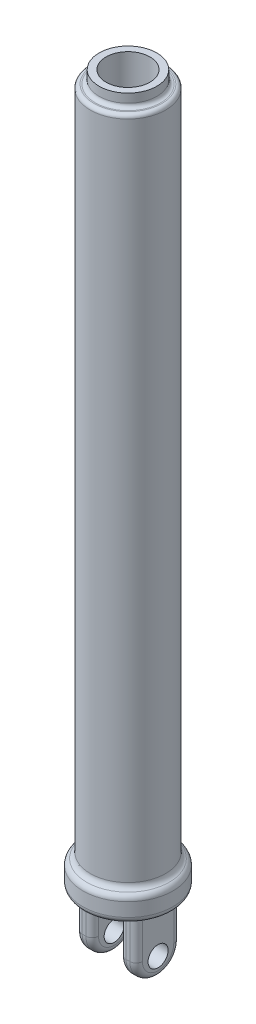
ISO-10303-21;
HEADER;
FILE_DESCRIPTION(('STEP AP214'),'2;1');
FILE_NAME('part.step','',(''),(''),'','','');
FILE_SCHEMA(('AUTOMOTIVE_DESIGN { 1 0 10303 214 1 1 1 1 }'));
ENDSEC;
DATA;
#1=APPLICATION_CONTEXT('core data for automotive mechanical design processes');
#2=APPLICATION_PROTOCOL_DEFINITION('international standard','automotive_design',2000,#1);
#3=PRODUCT_CONTEXT('',#1,'mechanical');
#4=PRODUCT('Part','Part','',(#3));
#5=PRODUCT_RELATED_PRODUCT_CATEGORY('part','',(#4));
#6=PRODUCT_DEFINITION_FORMATION('','',#4);
#7=PRODUCT_DEFINITION_CONTEXT('part definition',#1,'design');
#8=PRODUCT_DEFINITION('design','',#6,#7);
#9=PRODUCT_DEFINITION_SHAPE('','',#8);
#10=(LENGTH_UNIT() NAMED_UNIT(*) SI_UNIT(.MILLI.,.METRE.));
#11=(NAMED_UNIT(*) PLANE_ANGLE_UNIT() SI_UNIT($,.RADIAN.));
#12=(NAMED_UNIT(*) SI_UNIT($,.STERADIAN.) SOLID_ANGLE_UNIT());
#13=UNCERTAINTY_MEASURE_WITH_UNIT(LENGTH_MEASURE(1.E-05),#10,'distance_accuracy_value','');
#14=(GEOMETRIC_REPRESENTATION_CONTEXT(3) GLOBAL_UNCERTAINTY_ASSIGNED_CONTEXT((#13)) GLOBAL_UNIT_ASSIGNED_CONTEXT((#10,
#11,#12)) REPRESENTATION_CONTEXT('',''));
#15=CARTESIAN_POINT('',(0.,0.,0.));
#16=DIRECTION('',(0.,0.,1.));
#17=DIRECTION('',(1.,0.,0.));
#18=AXIS2_PLACEMENT_3D('',#15,#16,#17);
#19=CARTESIAN_POINT('',(24.,-50.,17.5));
#20=DIRECTION('',(-1.,0.,0.));
#21=DIRECTION('',(0.,0.,1.));
#22=AXIS2_PLACEMENT_3D('',#19,#20,#21);
#23=PLANE('',#22);
#24=DIRECTION('',(0.,0.,1.));
#25=VECTOR('',#24,1.);
#26=CARTESIAN_POINT('',(24.,0.,17.5));
#27=LINE('',#26,#25);
#28=CARTESIAN_POINT('',(24.,0.,-12.5));
#29=VERTEX_POINT('',#28);
#30=CARTESIAN_POINT('',(24.,0.,12.5));
#31=VERTEX_POINT('',#30);
#32=EDGE_CURVE('E307',#29,#31,#27,.T.);
#33=ORIENTED_EDGE('',*,*,#32,.T.);
#34=DIRECTION('',(0.,1.,0.));
#35=VECTOR('',#34,1.);
#36=CARTESIAN_POINT('',(24.,-50.,12.5));
#37=LINE('',#36,#35);
#38=CARTESIAN_POINT('',(24.,-32.5,12.5));
#39=VERTEX_POINT('',#38);
#40=EDGE_CURVE('E359',#31,#39,#37,.F.);
#41=ORIENTED_EDGE('',*,*,#40,.T.);
#42=CARTESIAN_POINT('',(24.,-32.5,0.));
#43=DIRECTION('',(-1.,0.,0.));
#44=DIRECTION('',(0.,0.,1.));
#45=AXIS2_PLACEMENT_3D('',#42,#43,#44);
#46=CIRCLE('',#45,12.5);
#47=CARTESIAN_POINT('',(24.,-32.5,-12.5));
#48=VERTEX_POINT('',#47);
#49=EDGE_CURVE('E355',#39,#48,#46,.F.);
#50=ORIENTED_EDGE('',*,*,#49,.T.);
#51=DIRECTION('',(0.,1.,0.));
#52=VECTOR('',#51,1.);
#53=CARTESIAN_POINT('',(24.,-50.,-12.5));
#54=LINE('',#53,#52);
#55=EDGE_CURVE('E357',#48,#29,#54,.T.);
#56=ORIENTED_EDGE('',*,*,#55,.T.);
#57=EDGE_LOOP('',(#33,#41,#50,#56));
#58=FACE_BOUND('',#57,.T.);
#59=CARTESIAN_POINT('',(24.,-35.,0.));
#60=DIRECTION('',(1.,0.,0.));
#61=DIRECTION('',(0.,0.,-1.));
#62=AXIS2_PLACEMENT_3D('',#59,#60,#61);
#63=CIRCLE('',#62,8.);
#64=CARTESIAN_POINT('',(24.,-35.,-8.00000000000002));
#65=VERTEX_POINT('',#64);
#66=EDGE_CURVE('E194',#65,#65,#63,.T.);
#67=ORIENTED_EDGE('',*,*,#66,.F.);
#68=EDGE_LOOP('',(#67));
#69=FACE_BOUND('',#68,.T.);
#70=ADVANCED_FACE('F56',(#58,#69),#23,.F.);
#71=CARTESIAN_POINT('',(11.,-50.,17.5));
#72=DIRECTION('',(1.,0.,0.));
#73=DIRECTION('',(0.,0.,-1.));
#74=AXIS2_PLACEMENT_3D('',#71,#72,#73);
#75=PLANE('',#74);
#76=CARTESIAN_POINT('',(11.,-35.,0.));
#77=DIRECTION('',(1.,0.,0.));
#78=DIRECTION('',(0.,0.,-1.));
#79=AXIS2_PLACEMENT_3D('',#76,#77,#78);
#80=CIRCLE('',#79,8.);
#81=CARTESIAN_POINT('',(11.,-35.,-8.00000000000003));
#82=VERTEX_POINT('',#81);
#83=EDGE_CURVE('E290',#82,#82,#80,.T.);
#84=ORIENTED_EDGE('',*,*,#83,.T.);
#85=EDGE_LOOP('',(#84));
#86=FACE_BOUND('',#85,.T.);
#87=CARTESIAN_POINT('',(11.,-32.5,0.));
#88=DIRECTION('',(1.,0.,0.));
#89=DIRECTION('',(0.,0.,-1.));
#90=AXIS2_PLACEMENT_3D('',#87,#88,#89);
#91=CIRCLE('',#90,12.5);
#92=CARTESIAN_POINT('',(11.,-32.5,-12.5));
#93=VERTEX_POINT('',#92);
#94=CARTESIAN_POINT('',(11.,-32.5,12.5));
#95=VERTEX_POINT('',#94);
#96=EDGE_CURVE('E365',#93,#95,#91,.F.);
#97=ORIENTED_EDGE('',*,*,#96,.T.);
#98=DIRECTION('',(0.,1.,0.));
#99=VECTOR('',#98,1.);
#100=CARTESIAN_POINT('',(11.,-50.,12.5));
#101=LINE('',#100,#99);
#102=CARTESIAN_POINT('',(11.,0.,12.5));
#103=VERTEX_POINT('',#102);
#104=EDGE_CURVE('E209',#95,#103,#101,.T.);
#105=ORIENTED_EDGE('',*,*,#104,.T.);
#106=DIRECTION('',(0.,0.,-1.));
#107=VECTOR('',#106,1.);
#108=CARTESIAN_POINT('',(11.,0.,17.5));
#109=LINE('',#108,#107);
#110=CARTESIAN_POINT('',(11.,0.,-12.5));
#111=VERTEX_POINT('',#110);
#112=EDGE_CURVE('E311',#103,#111,#109,.T.);
#113=ORIENTED_EDGE('',*,*,#112,.T.);
#114=DIRECTION('',(0.,1.,0.));
#115=VECTOR('',#114,1.);
#116=CARTESIAN_POINT('',(11.,-50.,-12.5));
#117=LINE('',#116,#115);
#118=EDGE_CURVE('E367',#111,#93,#117,.F.);
#119=ORIENTED_EDGE('',*,*,#118,.T.);
#120=EDGE_LOOP('',(#97,#105,#113,#119));
#121=FACE_BOUND('',#120,.T.);
#122=ADVANCED_FACE('F412',(#86,#121),#75,.F.);
#123=CARTESIAN_POINT('',(-11.,-50.,17.5));
#124=DIRECTION('',(-1.,0.,0.));
#125=DIRECTION('',(0.,0.,1.));
#126=AXIS2_PLACEMENT_3D('',#123,#124,#125);
#127=PLANE('',#126);
#128=CARTESIAN_POINT('',(-11.,-35.,0.));
#129=DIRECTION('',(-1.,0.,0.));
#130=DIRECTION('',(0.,0.,1.));
#131=AXIS2_PLACEMENT_3D('',#128,#129,#130);
#132=CIRCLE('',#131,8.);
#133=CARTESIAN_POINT('',(-11.,-35.,7.99999999999997));
#134=VERTEX_POINT('',#133);
#135=EDGE_CURVE('E287',#134,#134,#132,.T.);
#136=ORIENTED_EDGE('',*,*,#135,.T.);
#137=EDGE_LOOP('',(#136));
#138=FACE_BOUND('',#137,.T.);
#139=CARTESIAN_POINT('',(-11.,-32.5,0.));
#140=DIRECTION('',(-1.,0.,0.));
#141=DIRECTION('',(0.,0.,1.));
#142=AXIS2_PLACEMENT_3D('',#139,#140,#141);
#143=CIRCLE('',#142,12.5);
#144=CARTESIAN_POINT('',(-11.,-32.5,12.5));
#145=VERTEX_POINT('',#144);
#146=CARTESIAN_POINT('',(-11.,-32.5,-12.5));
#147=VERTEX_POINT('',#146);
#148=EDGE_CURVE('E370',#145,#147,#143,.F.);
#149=ORIENTED_EDGE('',*,*,#148,.T.);
#150=DIRECTION('',(0.,1.,0.));
#151=VECTOR('',#150,1.);
#152=CARTESIAN_POINT('',(-11.,-50.,-12.5));
#153=LINE('',#152,#151);
#154=CARTESIAN_POINT('',(-11.,0.,-12.5));
#155=VERTEX_POINT('',#154);
#156=EDGE_CURVE('E241',#147,#155,#153,.T.);
#157=ORIENTED_EDGE('',*,*,#156,.T.);
#158=DIRECTION('',(0.,0.,1.));
#159=VECTOR('',#158,1.);
#160=CARTESIAN_POINT('',(-11.,0.,17.5));
#161=LINE('',#160,#159);
#162=CARTESIAN_POINT('',(-11.,0.,12.5));
#163=VERTEX_POINT('',#162);
#164=EDGE_CURVE('E297',#155,#163,#161,.T.);
#165=ORIENTED_EDGE('',*,*,#164,.T.);
#166=DIRECTION('',(0.,1.,0.));
#167=VECTOR('',#166,1.);
#168=CARTESIAN_POINT('',(-11.,-50.,12.5));
#169=LINE('',#168,#167);
#170=EDGE_CURVE('E246',#163,#145,#169,.F.);
#171=ORIENTED_EDGE('',*,*,#170,.T.);
#172=EDGE_LOOP('',(#149,#157,#165,#171));
#173=FACE_BOUND('',#172,.T.);
#174=ADVANCED_FACE('F374',(#138,#173),#127,.F.);
#175=CARTESIAN_POINT('',(-24.,-50.,17.5));
#176=DIRECTION('',(1.,0.,0.));
#177=DIRECTION('',(0.,0.,-1.));
#178=AXIS2_PLACEMENT_3D('',#175,#176,#177);
#179=PLANE('',#178);
#180=CARTESIAN_POINT('',(-24.,-35.,0.));
#181=DIRECTION('',(1.,0.,0.));
#182=DIRECTION('',(0.,0.,-1.));
#183=AXIS2_PLACEMENT_3D('',#180,#181,#182);
#184=CIRCLE('',#183,8.);
#185=CARTESIAN_POINT('',(-24.,-35.,-8.00000000000004));
#186=VERTEX_POINT('',#185);
#187=EDGE_CURVE('E286',#186,#186,#184,.T.);
#188=ORIENTED_EDGE('',*,*,#187,.T.);
#189=EDGE_LOOP('',(#188));
#190=FACE_BOUND('',#189,.T.);
#191=CARTESIAN_POINT('',(-24.,-32.5,0.));
#192=DIRECTION('',(1.,0.,0.));
#193=DIRECTION('',(0.,0.,-1.));
#194=AXIS2_PLACEMENT_3D('',#191,#192,#193);
#195=CIRCLE('',#194,12.5);
#196=CARTESIAN_POINT('',(-24.,-32.5,-12.5));
#197=VERTEX_POINT('',#196);
#198=CARTESIAN_POINT('',(-24.,-32.5,12.5));
#199=VERTEX_POINT('',#198);
#200=EDGE_CURVE('E73',#197,#199,#195,.F.);
#201=ORIENTED_EDGE('',*,*,#200,.T.);
#202=DIRECTION('',(0.,1.,0.));
#203=VECTOR('',#202,1.);
#204=CARTESIAN_POINT('',(-24.,-50.,12.5));
#205=LINE('',#204,#203);
#206=CARTESIAN_POINT('',(-24.,0.,12.5));
#207=VERTEX_POINT('',#206);
#208=EDGE_CURVE('E205',#199,#207,#205,.T.);
#209=ORIENTED_EDGE('',*,*,#208,.T.);
#210=DIRECTION('',(0.,0.,-1.));
#211=VECTOR('',#210,1.);
#212=CARTESIAN_POINT('',(-24.,0.,17.5));
#213=LINE('',#212,#211);
#214=CARTESIAN_POINT('',(-24.,0.,-12.5));
#215=VERTEX_POINT('',#214);
#216=EDGE_CURVE('E303',#207,#215,#213,.T.);
#217=ORIENTED_EDGE('',*,*,#216,.T.);
#218=DIRECTION('',(0.,1.,0.));
#219=VECTOR('',#218,1.);
#220=CARTESIAN_POINT('',(-24.,-50.,-12.5));
#221=LINE('',#220,#219);
#222=EDGE_CURVE('E78',#215,#197,#221,.F.);
#223=ORIENTED_EDGE('',*,*,#222,.T.);
#224=EDGE_LOOP('',(#201,#209,#217,#223));
#225=FACE_BOUND('',#224,.T.);
#226=ADVANCED_FACE('F397',(#190,#225),#179,.F.);
#227=CARTESIAN_POINT('',(11.,-50.,-17.5));
#228=DIRECTION('',(0.,0.,1.));
#229=DIRECTION('',(1.,0.,0.));
#230=AXIS2_PLACEMENT_3D('',#227,#228,#229);
#231=PLANE('',#230);
#232=DIRECTION('',(1.,0.,0.));
#233=VECTOR('',#232,1.);
#234=CARTESIAN_POINT('',(11.,0.,-17.5));
#235=LINE('',#234,#233);
#236=CARTESIAN_POINT('',(16.,0.,-17.5));
#237=VERTEX_POINT('',#236);
#238=CARTESIAN_POINT('',(19.,0.,-17.5));
#239=VERTEX_POINT('',#238);
#240=EDGE_CURVE('E314',#237,#239,#235,.T.);
#241=ORIENTED_EDGE('',*,*,#240,.T.);
#242=DIRECTION('',(0.,1.,0.));
#243=VECTOR('',#242,1.);
#244=CARTESIAN_POINT('',(19.,-50.,-17.5));
#245=LINE('',#244,#243);
#246=CARTESIAN_POINT('',(19.,-32.5,-17.5));
#247=VERTEX_POINT('',#246);
#248=EDGE_CURVE('E363',#239,#247,#245,.F.);
#249=ORIENTED_EDGE('',*,*,#248,.T.);
#250=DIRECTION('',(1.,0.,0.));
#251=VECTOR('',#250,1.);
#252=CARTESIAN_POINT('',(-35.8238545691089,-32.5,-17.5));
#253=LINE('',#252,#251);
#254=CARTESIAN_POINT('',(16.,-32.5,-17.5));
#255=VERTEX_POINT('',#254);
#256=EDGE_CURVE('E293',#255,#247,#253,.T.);
#257=ORIENTED_EDGE('',*,*,#256,.F.);
#258=DIRECTION('',(0.,1.,0.));
#259=VECTOR('',#258,1.);
#260=CARTESIAN_POINT('',(16.,-50.,-17.5));
#261=LINE('',#260,#259);
#262=EDGE_CURVE('E361',#255,#237,#261,.T.);
#263=ORIENTED_EDGE('',*,*,#262,.T.);
#264=EDGE_LOOP('',(#241,#249,#257,#263));
#265=FACE_BOUND('',#264,.T.);
#266=ADVANCED_FACE('F593',(#265),#231,.F.);
#267=CARTESIAN_POINT('',(-11.,-50.,-17.5));
#268=DIRECTION('',(0.,0.,1.));
#269=DIRECTION('',(1.,0.,0.));
#270=AXIS2_PLACEMENT_3D('',#267,#268,#269);
#271=PLANE('',#270);
#272=DIRECTION('',(1.,0.,0.));
#273=VECTOR('',#272,1.);
#274=CARTESIAN_POINT('',(-11.,0.,-17.5));
#275=LINE('',#274,#273);
#276=CARTESIAN_POINT('',(-19.,0.,-17.5));
#277=VERTEX_POINT('',#276);
#278=CARTESIAN_POINT('',(-16.,0.,-17.5));
#279=VERTEX_POINT('',#278);
#280=EDGE_CURVE('E305',#277,#279,#275,.T.);
#281=ORIENTED_EDGE('',*,*,#280,.T.);
#282=DIRECTION('',(0.,1.,0.));
#283=VECTOR('',#282,1.);
#284=CARTESIAN_POINT('',(-16.,-50.,-17.5));
#285=LINE('',#284,#283);
#286=CARTESIAN_POINT('',(-16.,-32.5,-17.5));
#287=VERTEX_POINT('',#286);
#288=EDGE_CURVE('E240',#279,#287,#285,.F.);
#289=ORIENTED_EDGE('',*,*,#288,.T.);
#290=CARTESIAN_POINT('',(-19.,-32.5,-17.5));
#291=VERTEX_POINT('',#290);
#292=EDGE_CURVE('E294',#291,#287,#253,.T.);
#293=ORIENTED_EDGE('',*,*,#292,.F.);
#294=DIRECTION('',(0.,1.,0.));
#295=VECTOR('',#294,1.);
#296=CARTESIAN_POINT('',(-19.,-50.,-17.5));
#297=LINE('',#296,#295);
#298=EDGE_CURVE('E235',#291,#277,#297,.T.);
#299=ORIENTED_EDGE('',*,*,#298,.T.);
#300=EDGE_LOOP('',(#281,#289,#293,#299));
#301=FACE_BOUND('',#300,.T.);
#302=ADVANCED_FACE('F398',(#301),#271,.F.);
#303=CARTESIAN_POINT('',(0.,0.,0.));
#304=DIRECTION('',(0.,-1.,0.));
#305=DIRECTION('',(0.,0.,-1.));
#306=AXIS2_PLACEMENT_3D('',#303,#304,#305);
#307=PLANE('',#306);
#308=CARTESIAN_POINT('',(0.,0.,0.));
#309=DIRECTION('',(0.,1.,0.));
#310=DIRECTION('',(0.,0.,1.));
#311=AXIS2_PLACEMENT_3D('',#308,#309,#310);
#312=CIRCLE('',#311,30.8238545691088);
#313=CARTESIAN_POINT('',(0.,0.,30.8238545691088));
#314=VERTEX_POINT('',#313);
#315=EDGE_CURVE('E183',#314,#314,#312,.T.);
#316=ORIENTED_EDGE('',*,*,#315,.F.);
#317=EDGE_LOOP('',(#316));
#318=FACE_BOUND('',#317,.T.);
#319=DIRECTION('',(-1.,0.,0.));
#320=VECTOR('',#319,1.);
#321=CARTESIAN_POINT('',(11.,0.,17.5));
#322=LINE('',#321,#320);
#323=CARTESIAN_POINT('',(19.,0.,17.5));
#324=VERTEX_POINT('',#323);
#325=CARTESIAN_POINT('',(16.,0.,17.5));
#326=VERTEX_POINT('',#325);
#327=EDGE_CURVE('E179',#324,#326,#322,.T.);
#328=ORIENTED_EDGE('',*,*,#327,.F.);
#329=CARTESIAN_POINT('',(19.,0.,12.5));
#330=DIRECTION('',(0.,-1.,0.));
#331=DIRECTION('',(0.,0.,-1.));
#332=AXIS2_PLACEMENT_3D('',#329,#330,#331);
#333=CIRCLE('',#332,5.);
#334=EDGE_CURVE('E260',#324,#31,#333,.F.);
#335=ORIENTED_EDGE('',*,*,#334,.T.);
#336=ORIENTED_EDGE('',*,*,#32,.F.);
#337=CARTESIAN_POINT('',(19.,0.,-12.5));
#338=DIRECTION('',(0.,-1.,0.));
#339=DIRECTION('',(0.,0.,-1.));
#340=AXIS2_PLACEMENT_3D('',#337,#338,#339);
#341=CIRCLE('',#340,5.);
#342=EDGE_CURVE('E262',#29,#239,#341,.F.);
#343=ORIENTED_EDGE('',*,*,#342,.T.);
#344=ORIENTED_EDGE('',*,*,#240,.F.);
#345=CARTESIAN_POINT('',(16.,0.,-12.5));
#346=DIRECTION('',(0.,-1.,0.));
#347=DIRECTION('',(0.,0.,-1.));
#348=AXIS2_PLACEMENT_3D('',#345,#346,#347);
#349=CIRCLE('',#348,5.);
#350=EDGE_CURVE('E266',#237,#111,#349,.F.);
#351=ORIENTED_EDGE('',*,*,#350,.T.);
#352=ORIENTED_EDGE('',*,*,#112,.F.);
#353=CARTESIAN_POINT('',(16.,0.,12.5));
#354=DIRECTION('',(0.,-1.,0.));
#355=DIRECTION('',(0.,0.,-1.));
#356=AXIS2_PLACEMENT_3D('',#353,#354,#355);
#357=CIRCLE('',#356,5.);
#358=EDGE_CURVE('E264',#103,#326,#357,.F.);
#359=ORIENTED_EDGE('',*,*,#358,.T.);
#360=EDGE_LOOP('',(#328,#335,#336,#343,#344,#351,#352,#359));
#361=FACE_BOUND('',#360,.T.);
#362=DIRECTION('',(-1.,0.,0.));
#363=VECTOR('',#362,1.);
#364=CARTESIAN_POINT('',(-11.,0.,17.5));
#365=LINE('',#364,#363);
#366=CARTESIAN_POINT('',(-16.,0.,17.5));
#367=VERTEX_POINT('',#366);
#368=CARTESIAN_POINT('',(-19.,0.,17.5));
#369=VERTEX_POINT('',#368);
#370=EDGE_CURVE('E300',#367,#369,#365,.T.);
#371=ORIENTED_EDGE('',*,*,#370,.F.);
#372=CARTESIAN_POINT('',(-16.,0.,12.5));
#373=DIRECTION('',(0.,-1.,0.));
#374=DIRECTION('',(0.,0.,-1.));
#375=AXIS2_PLACEMENT_3D('',#372,#373,#374);
#376=CIRCLE('',#375,5.);
#377=EDGE_CURVE('E270',#367,#163,#376,.F.);
#378=ORIENTED_EDGE('',*,*,#377,.T.);
#379=ORIENTED_EDGE('',*,*,#164,.F.);
#380=CARTESIAN_POINT('',(-16.,0.,-12.5));
#381=DIRECTION('',(0.,-1.,0.));
#382=DIRECTION('',(0.,0.,-1.));
#383=AXIS2_PLACEMENT_3D('',#380,#381,#382);
#384=CIRCLE('',#383,5.);
#385=EDGE_CURVE('E268',#155,#279,#384,.F.);
#386=ORIENTED_EDGE('',*,*,#385,.T.);
#387=ORIENTED_EDGE('',*,*,#280,.F.);
#388=CARTESIAN_POINT('',(-19.,0.,-12.5));
#389=DIRECTION('',(0.,-1.,0.));
#390=DIRECTION('',(0.,0.,-1.));
#391=AXIS2_PLACEMENT_3D('',#388,#389,#390);
#392=CIRCLE('',#391,5.);
#393=EDGE_CURVE('E12',#277,#215,#392,.F.);
#394=ORIENTED_EDGE('',*,*,#393,.T.);
#395=ORIENTED_EDGE('',*,*,#216,.F.);
#396=CARTESIAN_POINT('',(-19.,0.,12.5));
#397=DIRECTION('',(0.,-1.,0.));
#398=DIRECTION('',(0.,0.,-1.));
#399=AXIS2_PLACEMENT_3D('',#396,#397,#398);
#400=CIRCLE('',#399,5.);
#401=EDGE_CURVE('E65',#207,#369,#400,.F.);
#402=ORIENTED_EDGE('',*,*,#401,.T.);
#403=EDGE_LOOP('',(#371,#378,#379,#386,#387,#394,#395,#402));
#404=FACE_BOUND('',#403,.T.);
#405=ADVANCED_FACE('F391',(#318,#361,#404),#307,.T.);
#406=CARTESIAN_POINT('',(0.,5.,0.));
#407=DIRECTION('',(0.,1.,0.));
#408=DIRECTION('',(0.,0.,1.));
#409=AXIS2_PLACEMENT_3D('',#406,#407,#408);
#410=TOROIDAL_SURFACE('',#409,30.8238545691088,5.);
#411=ORIENTED_EDGE('',*,*,#315,.T.);
#412=EDGE_LOOP('',(#411));
#413=FACE_BOUND('',#412,.T.);
#414=CARTESIAN_POINT('',(0.,5.,0.));
#415=DIRECTION('',(0.,1.,0.));
#416=DIRECTION('',(0.,0.,1.));
#417=AXIS2_PLACEMENT_3D('',#414,#415,#416);
#418=CIRCLE('',#417,35.8238545691088);
#419=CARTESIAN_POINT('',(0.,5.,35.8238545691088));
#420=VERTEX_POINT('',#419);
#421=EDGE_CURVE('E347',#420,#420,#418,.T.);
#422=ORIENTED_EDGE('',*,*,#421,.F.);
#423=EDGE_LOOP('',(#422));
#424=FACE_BOUND('',#423,.T.);
#425=ADVANCED_FACE('F466',(#413,#424),#410,.T.);
#426=CARTESIAN_POINT('',(0.,40.,0.));
#427=DIRECTION('',(0.,1.,0.));
#428=DIRECTION('',(0.,0.,1.));
#429=AXIS2_PLACEMENT_3D('',#426,#427,#428);
#430=CYLINDRICAL_SURFACE('',#429,35.8238545691088);
#431=ORIENTED_EDGE('',*,*,#421,.T.);
#432=EDGE_LOOP('',(#431));
#433=FACE_BOUND('',#432,.T.);
#434=CARTESIAN_POINT('',(0.,15.8911155052431,0.));
#435=DIRECTION('',(0.,1.,0.));
#436=DIRECTION('',(0.,0.,1.));
#437=AXIS2_PLACEMENT_3D('',#434,#435,#436);
#438=CIRCLE('',#437,35.8238545691088);
#439=CARTESIAN_POINT('',(0.,15.8911155052431,35.8238545691088));
#440=VERTEX_POINT('',#439);
#441=EDGE_CURVE('E344',#440,#440,#438,.T.);
#442=ORIENTED_EDGE('',*,*,#441,.F.);
#443=EDGE_LOOP('',(#442));
#444=FACE_BOUND('',#443,.T.);
#445=ADVANCED_FACE('F462',(#433,#444),#430,.T.);
#446=CARTESIAN_POINT('',(0.,15.8911155052431,0.));
#447=DIRECTION('',(0.,1.,0.));
#448=DIRECTION('',(0.,0.,1.));
#449=AXIS2_PLACEMENT_3D('',#446,#447,#448);
#450=TOROIDAL_SURFACE('',#449,30.8238545691088,5.);
#451=ORIENTED_EDGE('',*,*,#441,.T.);
#452=EDGE_LOOP('',(#451));
#453=FACE_BOUND('',#452,.T.);
#454=CARTESIAN_POINT('',(0.,20.434236936045,0.));
#455=DIRECTION('',(0.,1.,0.));
#456=DIRECTION('',(0.,0.,1.));
#457=AXIS2_PLACEMENT_3D('',#454,#455,#456);
#458=CIRCLE('',#457,32.9119272845545);
#459=CARTESIAN_POINT('',(0.,20.434236936045,32.9119272845545));
#460=VERTEX_POINT('',#459);
#461=EDGE_CURVE('E341',#460,#460,#458,.T.);
#462=ORIENTED_EDGE('',*,*,#461,.F.);
#463=EDGE_LOOP('',(#462));
#464=FACE_BOUND('',#463,.T.);
#465=ADVANCED_FACE('F458',(#453,#464),#450,.T.);
#466=CARTESIAN_POINT('',(0.,24.9773583668469,0.));
#467=DIRECTION('',(0.,1.,0.));
#468=DIRECTION('',(0.,0.,1.));
#469=AXIS2_PLACEMENT_3D('',#466,#467,#468);
#470=TOROIDAL_SURFACE('',#469,35.0000000000001,4.99999999999999);
#471=ORIENTED_EDGE('',*,*,#461,.T.);
#472=EDGE_LOOP('',(#471));
#473=FACE_BOUND('',#472,.T.);
#474=CARTESIAN_POINT('',(0.,24.9773583668469,0.));
#475=DIRECTION('',(0.,1.,0.));
#476=DIRECTION('',(0.,0.,1.));
#477=AXIS2_PLACEMENT_3D('',#474,#475,#476);
#478=CIRCLE('',#477,30.0000000000001);
#479=CARTESIAN_POINT('',(0.,24.9773583668469,30.0000000000001));
#480=VERTEX_POINT('',#479);
#481=EDGE_CURVE('E338',#480,#480,#478,.T.);
#482=ORIENTED_EDGE('',*,*,#481,.F.);
#483=EDGE_LOOP('',(#482));
#484=FACE_BOUND('',#483,.T.);
#485=ADVANCED_FACE('F454',(#473,#484),#470,.F.);
#486=CARTESIAN_POINT('',(0.,40.,0.));
#487=DIRECTION('',(0.,1.,0.));
#488=DIRECTION('',(0.,0.,1.));
#489=AXIS2_PLACEMENT_3D('',#486,#487,#488);
#490=CYLINDRICAL_SURFACE('',#489,30.);
#491=ORIENTED_EDGE('',*,*,#481,.T.);
#492=EDGE_LOOP('',(#491));
#493=FACE_BOUND('',#492,.T.);
#494=CARTESIAN_POINT('',(0.,552.,0.));
#495=DIRECTION('',(0.,1.,0.));
#496=DIRECTION('',(0.,0.,1.));
#497=AXIS2_PLACEMENT_3D('',#494,#495,#496);
#498=CIRCLE('',#497,30.);
#499=CARTESIAN_POINT('',(0.,552.,30.));
#500=VERTEX_POINT('',#499);
#501=EDGE_CURVE('E335',#500,#500,#498,.T.);
#502=ORIENTED_EDGE('',*,*,#501,.F.);
#503=EDGE_LOOP('',(#502));
#504=FACE_BOUND('',#503,.T.);
#505=ADVANCED_FACE('F450',(#493,#504),#490,.T.);
#506=CARTESIAN_POINT('',(0.,552.,0.));
#507=DIRECTION('',(0.,1.,0.));
#508=DIRECTION('',(0.,0.,1.));
#509=AXIS2_PLACEMENT_3D('',#506,#507,#508);
#510=TOROIDAL_SURFACE('',#509,27.,3.);
#511=ORIENTED_EDGE('',*,*,#501,.T.);
#512=EDGE_LOOP('',(#511));
#513=FACE_BOUND('',#512,.T.);
#514=CARTESIAN_POINT('',(0.,555.,0.));
#515=DIRECTION('',(0.,1.,0.));
#516=DIRECTION('',(0.,0.,1.));
#517=AXIS2_PLACEMENT_3D('',#514,#515,#516);
#518=CIRCLE('',#517,27.);
#519=CARTESIAN_POINT('',(0.,555.,27.));
#520=VERTEX_POINT('',#519);
#521=EDGE_CURVE('E332',#520,#520,#518,.T.);
#522=ORIENTED_EDGE('',*,*,#521,.F.);
#523=EDGE_LOOP('',(#522));
#524=FACE_BOUND('',#523,.T.);
#525=ADVANCED_FACE('F446',(#513,#524),#510,.T.);
#526=CARTESIAN_POINT('',(-27.,555.,0.));
#527=DIRECTION('',(0.,1.,0.));
#528=DIRECTION('',(0.,0.,1.));
#529=AXIS2_PLACEMENT_3D('',#526,#527,#528);
#530=PLANE('',#529);
#531=ORIENTED_EDGE('',*,*,#521,.T.);
#532=EDGE_LOOP('',(#531));
#533=FACE_BOUND('',#532,.T.);
#534=CARTESIAN_POINT('',(0.,555.,0.));
#535=DIRECTION('',(0.,1.,0.));
#536=DIRECTION('',(0.,0.,1.));
#537=AXIS2_PLACEMENT_3D('',#534,#535,#536);
#538=CIRCLE('',#537,26.);
#539=CARTESIAN_POINT('',(0.,555.,26.));
#540=VERTEX_POINT('',#539);
#541=EDGE_CURVE('E329',#540,#540,#538,.T.);
#542=ORIENTED_EDGE('',*,*,#541,.F.);
#543=EDGE_LOOP('',(#542));
#544=FACE_BOUND('',#543,.T.);
#545=ADVANCED_FACE('F442',(#533,#544),#530,.T.);
#546=CARTESIAN_POINT('',(0.,558.,0.));
#547=DIRECTION('',(0.,1.,0.));
#548=DIRECTION('',(0.,0.,1.));
#549=AXIS2_PLACEMENT_3D('',#546,#547,#548);
#550=TOROIDAL_SURFACE('',#549,26.,3.00000000000011);
#551=ORIENTED_EDGE('',*,*,#541,.T.);
#552=EDGE_LOOP('',(#551));
#553=FACE_BOUND('',#552,.T.);
#554=CARTESIAN_POINT('',(0.,558.,0.));
#555=DIRECTION('',(0.,1.,0.));
#556=DIRECTION('',(0.,0.,1.));
#557=AXIS2_PLACEMENT_3D('',#554,#555,#556);
#558=CIRCLE('',#557,22.9999999999999);
#559=CARTESIAN_POINT('',(0.,558.,22.9999999999999));
#560=VERTEX_POINT('',#559);
#561=EDGE_CURVE('E326',#560,#560,#558,.T.);
#562=ORIENTED_EDGE('',*,*,#561,.F.);
#563=EDGE_LOOP('',(#562));
#564=FACE_BOUND('',#563,.T.);
#565=ADVANCED_FACE('F438',(#553,#564),#550,.F.);
#566=CARTESIAN_POINT('',(0.,40.,0.));
#567=DIRECTION('',(0.,1.,0.));
#568=DIRECTION('',(0.,0.,1.));
#569=AXIS2_PLACEMENT_3D('',#566,#567,#568);
#570=CYLINDRICAL_SURFACE('',#569,22.9999999999999);
#571=ORIENTED_EDGE('',*,*,#561,.T.);
#572=EDGE_LOOP('',(#571));
#573=FACE_BOUND('',#572,.T.);
#574=CARTESIAN_POINT('',(0.,565.,0.));
#575=DIRECTION('',(0.,1.,0.));
#576=DIRECTION('',(0.,0.,1.));
#577=AXIS2_PLACEMENT_3D('',#574,#575,#576);
#578=CIRCLE('',#577,23.);
#579=CARTESIAN_POINT('',(0.,565.,23.));
#580=VERTEX_POINT('',#579);
#581=EDGE_CURVE('E323',#580,#580,#578,.T.);
#582=ORIENTED_EDGE('',*,*,#581,.F.);
#583=EDGE_LOOP('',(#582));
#584=FACE_BOUND('',#583,.T.);
#585=ADVANCED_FACE('F434',(#573,#584),#570,.T.);
#586=CARTESIAN_POINT('',(-17.5,565.,0.));
#587=DIRECTION('',(0.,1.,0.));
#588=DIRECTION('',(0.,0.,1.));
#589=AXIS2_PLACEMENT_3D('',#586,#587,#588);
#590=PLANE('',#589);
#591=ORIENTED_EDGE('',*,*,#581,.T.);
#592=EDGE_LOOP('',(#591));
#593=FACE_BOUND('',#592,.T.);
#594=CARTESIAN_POINT('',(0.,565.,0.));
#595=DIRECTION('',(0.,1.,0.));
#596=DIRECTION('',(0.,0.,1.));
#597=AXIS2_PLACEMENT_3D('',#594,#595,#596);
#598=CIRCLE('',#597,17.5);
#599=CARTESIAN_POINT('',(0.,565.,17.5));
#600=VERTEX_POINT('',#599);
#601=EDGE_CURVE('E320',#600,#600,#598,.T.);
#602=ORIENTED_EDGE('',*,*,#601,.F.);
#603=EDGE_LOOP('',(#602));
#604=FACE_BOUND('',#603,.T.);
#605=ADVANCED_FACE('F430',(#593,#604),#590,.T.);
#606=CARTESIAN_POINT('',(0.,40.,0.));
#607=DIRECTION('',(0.,1.,0.));
#608=DIRECTION('',(0.,0.,1.));
#609=AXIS2_PLACEMENT_3D('',#606,#607,#608);
#610=CYLINDRICAL_SURFACE('',#609,17.5);
#611=ORIENTED_EDGE('',*,*,#601,.T.);
#612=EDGE_LOOP('',(#611));
#613=FACE_BOUND('',#612,.T.);
#614=CARTESIAN_POINT('',(0.,40.,0.));
#615=DIRECTION('',(0.,1.,0.));
#616=DIRECTION('',(0.,0.,1.));
#617=AXIS2_PLACEMENT_3D('',#614,#615,#616);
#618=CIRCLE('',#617,17.4999999999999);
#619=CARTESIAN_POINT('',(0.,40.,17.4999999999999));
#620=VERTEX_POINT('',#619);
#621=EDGE_CURVE('E317',#620,#620,#618,.T.);
#622=ORIENTED_EDGE('',*,*,#621,.F.);
#623=EDGE_LOOP('',(#622));
#624=FACE_BOUND('',#623,.T.);
#625=ADVANCED_FACE('F426',(#613,#624),#610,.F.);
#626=CARTESIAN_POINT('',(-17.4999999999999,40.,0.));
#627=DIRECTION('',(0.,1.,0.));
#628=DIRECTION('',(0.,0.,1.));
#629=AXIS2_PLACEMENT_3D('',#626,#627,#628);
#630=PLANE('',#629);
#631=ORIENTED_EDGE('',*,*,#621,.T.);
#632=EDGE_LOOP('',(#631));
#633=FACE_BOUND('',#632,.T.);
#634=ADVANCED_FACE('F423',(#633),#630,.T.);
#635=CARTESIAN_POINT('',(11.,-50.,17.5));
#636=DIRECTION('',(0.,0.,-1.));
#637=DIRECTION('',(-1.,0.,0.));
#638=AXIS2_PLACEMENT_3D('',#635,#636,#637);
#639=PLANE('',#638);
#640=DIRECTION('',(1.,0.,0.));
#641=VECTOR('',#640,1.);
#642=CARTESIAN_POINT('',(-35.8238545691089,-32.5,17.5));
#643=LINE('',#642,#641);
#644=CARTESIAN_POINT('',(16.,-32.5,17.5));
#645=VERTEX_POINT('',#644);
#646=CARTESIAN_POINT('',(19.,-32.5,17.5));
#647=VERTEX_POINT('',#646);
#648=EDGE_CURVE('E176',#645,#647,#643,.T.);
#649=ORIENTED_EDGE('',*,*,#648,.T.);
#650=DIRECTION('',(0.,1.,0.));
#651=VECTOR('',#650,1.);
#652=CARTESIAN_POINT('',(19.,-50.,17.5));
#653=LINE('',#652,#651);
#654=EDGE_CURVE('E182',#647,#324,#653,.T.);
#655=ORIENTED_EDGE('',*,*,#654,.T.);
#656=ORIENTED_EDGE('',*,*,#327,.T.);
#657=DIRECTION('',(0.,1.,0.));
#658=VECTOR('',#657,1.);
#659=CARTESIAN_POINT('',(16.,-50.,17.5));
#660=LINE('',#659,#658);
#661=EDGE_CURVE('E172',#326,#645,#660,.F.);
#662=ORIENTED_EDGE('',*,*,#661,.T.);
#663=EDGE_LOOP('',(#649,#655,#656,#662));
#664=FACE_BOUND('',#663,.T.);
#665=ADVANCED_FACE('F174',(#664),#639,.F.);
#666=CARTESIAN_POINT('',(-11.,-50.,17.5));
#667=DIRECTION('',(0.,0.,-1.));
#668=DIRECTION('',(-1.,0.,0.));
#669=AXIS2_PLACEMENT_3D('',#666,#667,#668);
#670=PLANE('',#669);
#671=CARTESIAN_POINT('',(-19.,-32.5,17.5));
#672=VERTEX_POINT('',#671);
#673=CARTESIAN_POINT('',(-16.,-32.5,17.5));
#674=VERTEX_POINT('',#673);
#675=EDGE_CURVE('E193',#672,#674,#643,.T.);
#676=ORIENTED_EDGE('',*,*,#675,.T.);
#677=DIRECTION('',(0.,1.,0.));
#678=VECTOR('',#677,1.);
#679=CARTESIAN_POINT('',(-16.,-50.,17.5));
#680=LINE('',#679,#678);
#681=EDGE_CURVE('E251',#674,#367,#680,.T.);
#682=ORIENTED_EDGE('',*,*,#681,.T.);
#683=ORIENTED_EDGE('',*,*,#370,.T.);
#684=DIRECTION('',(0.,1.,0.));
#685=VECTOR('',#684,1.);
#686=CARTESIAN_POINT('',(-19.,-50.,17.5));
#687=LINE('',#686,#685);
#688=EDGE_CURVE('E243',#369,#672,#687,.F.);
#689=ORIENTED_EDGE('',*,*,#688,.T.);
#690=EDGE_LOOP('',(#676,#682,#683,#689));
#691=FACE_BOUND('',#690,.T.);
#692=ADVANCED_FACE('F394',(#691),#670,.F.);
#693=CARTESIAN_POINT('',(-35.8238545691089,-32.5,0.));
#694=DIRECTION('',(1.,0.,0.));
#695=DIRECTION('',(0.,0.,-1.));
#696=AXIS2_PLACEMENT_3D('',#693,#694,#695);
#697=CYLINDRICAL_SURFACE('',#696,17.5);
#698=ORIENTED_EDGE('',*,*,#292,.T.);
#699=CARTESIAN_POINT('',(-16.,-32.5,0.));
#700=DIRECTION('',(-1.,0.,0.));
#701=DIRECTION('',(0.,0.,1.));
#702=AXIS2_PLACEMENT_3D('',#699,#700,#701);
#703=CIRCLE('',#702,17.5);
#704=EDGE_CURVE('E258',#287,#674,#703,.T.);
#705=ORIENTED_EDGE('',*,*,#704,.T.);
#706=ORIENTED_EDGE('',*,*,#675,.F.);
#707=CARTESIAN_POINT('',(-19.,-32.5,0.));
#708=DIRECTION('',(1.,0.,0.));
#709=DIRECTION('',(0.,0.,-1.));
#710=AXIS2_PLACEMENT_3D('',#707,#708,#709);
#711=CIRCLE('',#710,17.5);
#712=EDGE_CURVE('E231',#672,#291,#711,.T.);
#713=ORIENTED_EDGE('',*,*,#712,.T.);
#714=EDGE_LOOP('',(#698,#705,#706,#713));
#715=FACE_BOUND('',#714,.T.);
#716=ADVANCED_FACE('F400',(#715),#697,.T.);
#717=ORIENTED_EDGE('',*,*,#256,.T.);
#718=CARTESIAN_POINT('',(19.,-32.5,0.));
#719=DIRECTION('',(-1.,0.,0.));
#720=DIRECTION('',(0.,0.,1.));
#721=AXIS2_PLACEMENT_3D('',#718,#719,#720);
#722=CIRCLE('',#721,17.5);
#723=EDGE_CURVE('E192',#247,#647,#722,.T.);
#724=ORIENTED_EDGE('',*,*,#723,.T.);
#725=ORIENTED_EDGE('',*,*,#648,.F.);
#726=CARTESIAN_POINT('',(16.,-32.5,0.));
#727=DIRECTION('',(1.,0.,0.));
#728=DIRECTION('',(0.,0.,-1.));
#729=AXIS2_PLACEMENT_3D('',#726,#727,#728);
#730=CIRCLE('',#729,17.5);
#731=EDGE_CURVE('E189',#645,#255,#730,.T.);
#732=ORIENTED_EDGE('',*,*,#731,.T.);
#733=EDGE_LOOP('',(#717,#724,#725,#732));
#734=FACE_BOUND('',#733,.T.);
#735=ADVANCED_FACE('F188',(#734),#697,.T.);
#736=CARTESIAN_POINT('',(-35.8238545691089,-35.,0.));
#737=DIRECTION('',(1.,0.,0.));
#738=DIRECTION('',(0.,0.,-1.));
#739=AXIS2_PLACEMENT_3D('',#736,#737,#738);
#740=CYLINDRICAL_SURFACE('',#739,8.);
#741=ORIENTED_EDGE('',*,*,#187,.F.);
#742=EDGE_LOOP('',(#741));
#743=FACE_BOUND('',#742,.T.);
#744=ORIENTED_EDGE('',*,*,#135,.F.);
#745=EDGE_LOOP('',(#744));
#746=FACE_BOUND('',#745,.T.);
#747=ADVANCED_FACE('F407',(#743,#746),#740,.F.);
#748=ORIENTED_EDGE('',*,*,#66,.T.);
#749=EDGE_LOOP('',(#748));
#750=FACE_BOUND('',#749,.T.);
#751=ORIENTED_EDGE('',*,*,#83,.F.);
#752=EDGE_LOOP('',(#751));
#753=FACE_BOUND('',#752,.T.);
#754=ADVANCED_FACE('F484',(#750,#753),#740,.F.);
#755=CARTESIAN_POINT('',(19.,-50.,-12.5));
#756=DIRECTION('',(0.,1.,0.));
#757=DIRECTION('',(0.,0.,1.));
#758=AXIS2_PLACEMENT_3D('',#755,#756,#757);
#759=CYLINDRICAL_SURFACE('',#758,5.);
#760=ORIENTED_EDGE('',*,*,#342,.F.);
#761=ORIENTED_EDGE('',*,*,#55,.F.);
#762=CARTESIAN_POINT('',(19.,-32.5,-12.5));
#763=DIRECTION('',(0.,-1.,0.));
#764=DIRECTION('',(0.,0.,-1.));
#765=AXIS2_PLACEMENT_3D('',#762,#763,#764);
#766=CIRCLE('',#765,5.);
#767=EDGE_CURVE('E218',#247,#48,#766,.T.);
#768=ORIENTED_EDGE('',*,*,#767,.F.);
#769=ORIENTED_EDGE('',*,*,#248,.F.);
#770=EDGE_LOOP('',(#760,#761,#768,#769));
#771=FACE_BOUND('',#770,.T.);
#772=ADVANCED_FACE('F481',(#771),#759,.T.);
#773=CARTESIAN_POINT('',(19.,-32.5,0.));
#774=DIRECTION('',(-1.,0.,0.));
#775=DIRECTION('',(0.,0.,1.));
#776=AXIS2_PLACEMENT_3D('',#773,#774,#775);
#777=TOROIDAL_SURFACE('',#776,12.5,5.);
#778=ORIENTED_EDGE('',*,*,#767,.T.);
#779=ORIENTED_EDGE('',*,*,#49,.F.);
#780=CARTESIAN_POINT('',(19.,-32.5,12.5));
#781=DIRECTION('',(0.,1.,0.));
#782=DIRECTION('',(0.,0.,1.));
#783=AXIS2_PLACEMENT_3D('',#780,#781,#782);
#784=CIRCLE('',#783,5.);
#785=EDGE_CURVE('E212',#647,#39,#784,.T.);
#786=ORIENTED_EDGE('',*,*,#785,.F.);
#787=ORIENTED_EDGE('',*,*,#723,.F.);
#788=EDGE_LOOP('',(#778,#779,#786,#787));
#789=FACE_BOUND('',#788,.T.);
#790=ADVANCED_FACE('F478',(#789),#777,.T.);
#791=CARTESIAN_POINT('',(19.,-50.,12.5));
#792=DIRECTION('',(0.,1.,0.));
#793=DIRECTION('',(0.,0.,1.));
#794=AXIS2_PLACEMENT_3D('',#791,#792,#793);
#795=CYLINDRICAL_SURFACE('',#794,5.);
#796=ORIENTED_EDGE('',*,*,#785,.T.);
#797=ORIENTED_EDGE('',*,*,#40,.F.);
#798=ORIENTED_EDGE('',*,*,#334,.F.);
#799=ORIENTED_EDGE('',*,*,#654,.F.);
#800=EDGE_LOOP('',(#796,#797,#798,#799));
#801=FACE_BOUND('',#800,.T.);
#802=ADVANCED_FACE('F474',(#801),#795,.T.);
#803=CARTESIAN_POINT('',(16.,-50.,-12.5));
#804=DIRECTION('',(0.,1.,0.));
#805=DIRECTION('',(0.,0.,1.));
#806=AXIS2_PLACEMENT_3D('',#803,#804,#805);
#807=CYLINDRICAL_SURFACE('',#806,5.);
#808=ORIENTED_EDGE('',*,*,#350,.F.);
#809=ORIENTED_EDGE('',*,*,#262,.F.);
#810=CARTESIAN_POINT('',(16.,-32.5,-12.5));
#811=DIRECTION('',(0.,-1.,0.));
#812=DIRECTION('',(0.,0.,-1.));
#813=AXIS2_PLACEMENT_3D('',#810,#811,#812);
#814=CIRCLE('',#813,5.);
#815=EDGE_CURVE('E204',#93,#255,#814,.T.);
#816=ORIENTED_EDGE('',*,*,#815,.F.);
#817=ORIENTED_EDGE('',*,*,#118,.F.);
#818=EDGE_LOOP('',(#808,#809,#816,#817));
#819=FACE_BOUND('',#818,.T.);
#820=ADVANCED_FACE('F477',(#819),#807,.T.);
#821=CARTESIAN_POINT('',(16.,-32.5,0.));
#822=DIRECTION('',(1.,0.,0.));
#823=DIRECTION('',(0.,0.,-1.));
#824=AXIS2_PLACEMENT_3D('',#821,#822,#823);
#825=TOROIDAL_SURFACE('',#824,12.5,5.);
#826=ORIENTED_EDGE('',*,*,#815,.T.);
#827=ORIENTED_EDGE('',*,*,#731,.F.);
#828=CARTESIAN_POINT('',(16.,-32.5,12.5));
#829=DIRECTION('',(0.,1.,0.));
#830=DIRECTION('',(0.,0.,1.));
#831=AXIS2_PLACEMENT_3D('',#828,#829,#830);
#832=CIRCLE('',#831,5.);
#833=EDGE_CURVE('E201',#95,#645,#832,.T.);
#834=ORIENTED_EDGE('',*,*,#833,.F.);
#835=ORIENTED_EDGE('',*,*,#96,.F.);
#836=EDGE_LOOP('',(#826,#827,#834,#835));
#837=FACE_BOUND('',#836,.T.);
#838=ADVANCED_FACE('F199',(#837),#825,.T.);
#839=CARTESIAN_POINT('',(16.,-50.,12.5));
#840=DIRECTION('',(0.,1.,0.));
#841=DIRECTION('',(0.,0.,1.));
#842=AXIS2_PLACEMENT_3D('',#839,#840,#841);
#843=CYLINDRICAL_SURFACE('',#842,5.);
#844=ORIENTED_EDGE('',*,*,#833,.T.);
#845=ORIENTED_EDGE('',*,*,#661,.F.);
#846=ORIENTED_EDGE('',*,*,#358,.F.);
#847=ORIENTED_EDGE('',*,*,#104,.F.);
#848=EDGE_LOOP('',(#844,#845,#846,#847));
#849=FACE_BOUND('',#848,.T.);
#850=ADVANCED_FACE('F207',(#849),#843,.T.);
#851=CARTESIAN_POINT('',(-16.,-50.,12.5));
#852=DIRECTION('',(0.,1.,0.));
#853=DIRECTION('',(0.,0.,1.));
#854=AXIS2_PLACEMENT_3D('',#851,#852,#853);
#855=CYLINDRICAL_SURFACE('',#854,5.);
#856=ORIENTED_EDGE('',*,*,#377,.F.);
#857=ORIENTED_EDGE('',*,*,#681,.F.);
#858=CARTESIAN_POINT('',(-16.,-32.5,12.5));
#859=DIRECTION('',(0.,-1.,0.));
#860=DIRECTION('',(0.,0.,-1.));
#861=AXIS2_PLACEMENT_3D('',#858,#859,#860);
#862=CIRCLE('',#861,5.);
#863=EDGE_CURVE('E210',#145,#674,#862,.T.);
#864=ORIENTED_EDGE('',*,*,#863,.F.);
#865=ORIENTED_EDGE('',*,*,#170,.F.);
#866=EDGE_LOOP('',(#856,#857,#864,#865));
#867=FACE_BOUND('',#866,.T.);
#868=ADVANCED_FACE('F381',(#867),#855,.T.);
#869=CARTESIAN_POINT('',(-16.,-32.5,0.));
#870=DIRECTION('',(-1.,0.,0.));
#871=DIRECTION('',(0.,0.,1.));
#872=AXIS2_PLACEMENT_3D('',#869,#870,#871);
#873=TOROIDAL_SURFACE('',#872,12.5,5.);
#874=ORIENTED_EDGE('',*,*,#863,.T.);
#875=ORIENTED_EDGE('',*,*,#704,.F.);
#876=CARTESIAN_POINT('',(-16.,-32.5,-12.5));
#877=DIRECTION('',(0.,1.,0.));
#878=DIRECTION('',(0.,0.,1.));
#879=AXIS2_PLACEMENT_3D('',#876,#877,#878);
#880=CIRCLE('',#879,5.);
#881=EDGE_CURVE('E215',#147,#287,#880,.T.);
#882=ORIENTED_EDGE('',*,*,#881,.F.);
#883=ORIENTED_EDGE('',*,*,#148,.F.);
#884=EDGE_LOOP('',(#874,#875,#882,#883));
#885=FACE_BOUND('',#884,.T.);
#886=ADVANCED_FACE('F384',(#885),#873,.T.);
#887=CARTESIAN_POINT('',(-16.,-50.,-12.5));
#888=DIRECTION('',(0.,1.,0.));
#889=DIRECTION('',(0.,0.,1.));
#890=AXIS2_PLACEMENT_3D('',#887,#888,#889);
#891=CYLINDRICAL_SURFACE('',#890,5.);
#892=ORIENTED_EDGE('',*,*,#881,.T.);
#893=ORIENTED_EDGE('',*,*,#288,.F.);
#894=ORIENTED_EDGE('',*,*,#385,.F.);
#895=ORIENTED_EDGE('',*,*,#156,.F.);
#896=EDGE_LOOP('',(#892,#893,#894,#895));
#897=FACE_BOUND('',#896,.T.);
#898=ADVANCED_FACE('F388',(#897),#891,.T.);
#899=CARTESIAN_POINT('',(-19.,-50.,-12.5));
#900=DIRECTION('',(0.,1.,0.));
#901=DIRECTION('',(0.,0.,1.));
#902=AXIS2_PLACEMENT_3D('',#899,#900,#901);
#903=CYLINDRICAL_SURFACE('',#902,5.);
#904=ORIENTED_EDGE('',*,*,#393,.F.);
#905=ORIENTED_EDGE('',*,*,#298,.F.);
#906=CARTESIAN_POINT('',(-19.,-32.5,-12.5));
#907=DIRECTION('',(0.,-1.,0.));
#908=DIRECTION('',(0.,0.,-1.));
#909=AXIS2_PLACEMENT_3D('',#906,#907,#908);
#910=CIRCLE('',#909,5.);
#911=EDGE_CURVE('E60',#197,#291,#910,.T.);
#912=ORIENTED_EDGE('',*,*,#911,.F.);
#913=ORIENTED_EDGE('',*,*,#222,.F.);
#914=EDGE_LOOP('',(#904,#905,#912,#913));
#915=FACE_BOUND('',#914,.T.);
#916=ADVANCED_FACE('F58',(#915),#903,.T.);
#917=CARTESIAN_POINT('',(-19.,-32.5,0.));
#918=DIRECTION('',(1.,0.,0.));
#919=DIRECTION('',(0.,0.,-1.));
#920=AXIS2_PLACEMENT_3D('',#917,#918,#919);
#921=TOROIDAL_SURFACE('',#920,12.5,5.);
#922=ORIENTED_EDGE('',*,*,#911,.T.);
#923=ORIENTED_EDGE('',*,*,#712,.F.);
#924=CARTESIAN_POINT('',(-19.,-32.5,12.5));
#925=DIRECTION('',(0.,1.,0.));
#926=DIRECTION('',(0.,0.,1.));
#927=AXIS2_PLACEMENT_3D('',#924,#925,#926);
#928=CIRCLE('',#927,5.);
#929=EDGE_CURVE('E222',#199,#672,#928,.T.);
#930=ORIENTED_EDGE('',*,*,#929,.F.);
#931=ORIENTED_EDGE('',*,*,#200,.F.);
#932=EDGE_LOOP('',(#922,#923,#930,#931));
#933=FACE_BOUND('',#932,.T.);
#934=ADVANCED_FACE('F230',(#933),#921,.T.);
#935=CARTESIAN_POINT('',(-19.,-50.,12.5));
#936=DIRECTION('',(0.,1.,0.));
#937=DIRECTION('',(0.,0.,1.));
#938=AXIS2_PLACEMENT_3D('',#935,#936,#937);
#939=CYLINDRICAL_SURFACE('',#938,5.);
#940=ORIENTED_EDGE('',*,*,#929,.T.);
#941=ORIENTED_EDGE('',*,*,#688,.F.);
#942=ORIENTED_EDGE('',*,*,#401,.F.);
#943=ORIENTED_EDGE('',*,*,#208,.F.);
#944=EDGE_LOOP('',(#940,#941,#942,#943));
#945=FACE_BOUND('',#944,.T.);
#946=ADVANCED_FACE('F396',(#945),#939,.T.);
#947=CLOSED_SHELL('',(#70,#122,#174,#226,#266,#302,#405,#425,#445,#465,#485,#505,#525,#545,#565,
#585,#605,#625,#634,#665,#692,#716,#735,#747,#754,#772,#790,#802,#820,#838,#850,#868,#886,#898,
#916,#934,#946));
#948=MANIFOLD_SOLID_BREP('B2',#947);
#949=ADVANCED_BREP_SHAPE_REPRESENTATION('',(#18,#948),#14);
#950=SHAPE_DEFINITION_REPRESENTATION(#9,#949);
ENDSEC;
END-ISO-10303-21;
